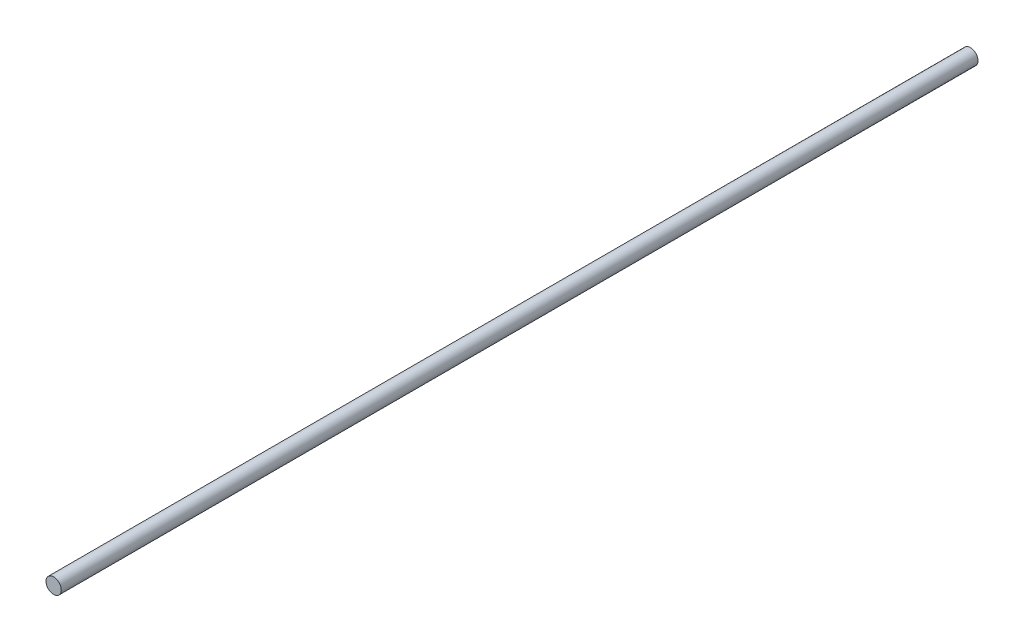
ISO-10303-21;
HEADER;
FILE_DESCRIPTION(('STEP AP214'),'2;1');
FILE_NAME('part.step','',(''),(''),'','','');
FILE_SCHEMA(('AUTOMOTIVE_DESIGN { 1 0 10303 214 1 1 1 1 }'));
ENDSEC;
DATA;
#1=APPLICATION_CONTEXT('core data for automotive mechanical design processes');
#2=APPLICATION_PROTOCOL_DEFINITION('international standard','automotive_design',2000,#1);
#3=PRODUCT_CONTEXT('',#1,'mechanical');
#4=PRODUCT('Part','Part','',(#3));
#5=PRODUCT_RELATED_PRODUCT_CATEGORY('part','',(#4));
#6=PRODUCT_DEFINITION_FORMATION('','',#4);
#7=PRODUCT_DEFINITION_CONTEXT('part definition',#1,'design');
#8=PRODUCT_DEFINITION('design','',#6,#7);
#9=PRODUCT_DEFINITION_SHAPE('','',#8);
#10=(LENGTH_UNIT() NAMED_UNIT(*) SI_UNIT(.MILLI.,.METRE.));
#11=(NAMED_UNIT(*) PLANE_ANGLE_UNIT() SI_UNIT($,.RADIAN.));
#12=(NAMED_UNIT(*) SI_UNIT($,.STERADIAN.) SOLID_ANGLE_UNIT());
#13=UNCERTAINTY_MEASURE_WITH_UNIT(LENGTH_MEASURE(1.E-05),#10,'distance_accuracy_value','');
#14=(GEOMETRIC_REPRESENTATION_CONTEXT(3) GLOBAL_UNCERTAINTY_ASSIGNED_CONTEXT((#13)) GLOBAL_UNIT_ASSIGNED_CONTEXT((#10,
#11,#12)) REPRESENTATION_CONTEXT('',''));
#15=CARTESIAN_POINT('',(0.,0.,0.));
#16=DIRECTION('',(0.,0.,1.));
#17=DIRECTION('',(1.,0.,0.));
#18=AXIS2_PLACEMENT_3D('',#15,#16,#17);
#19=CARTESIAN_POINT('',(0.,0.,476.25));
#20=DIRECTION('',(0.,0.,-1.));
#21=DIRECTION('',(-1.,0.,0.));
#22=AXIS2_PLACEMENT_3D('',#19,#20,#21);
#23=CYLINDRICAL_SURFACE('',#22,3.96875);
#24=CARTESIAN_POINT('',(0.,0.,476.25));
#25=DIRECTION('',(0.,0.,1.));
#26=DIRECTION('',(1.,0.,0.));
#27=AXIS2_PLACEMENT_3D('',#24,#25,#26);
#28=CIRCLE('',#27,3.96875);
#29=CARTESIAN_POINT('',(3.96875,0.,476.25));
#30=VERTEX_POINT('',#29);
#31=EDGE_CURVE('E10',#30,#30,#28,.T.);
#32=ORIENTED_EDGE('',*,*,#31,.F.);
#33=EDGE_LOOP('',(#32));
#34=FACE_BOUND('',#33,.T.);
#35=CARTESIAN_POINT('',(0.,0.,0.));
#36=DIRECTION('',(0.,0.,1.));
#37=DIRECTION('',(1.,0.,0.));
#38=AXIS2_PLACEMENT_3D('',#35,#36,#37);
#39=CIRCLE('',#38,3.96875);
#40=CARTESIAN_POINT('',(3.96875,0.,0.));
#41=VERTEX_POINT('',#40);
#42=EDGE_CURVE('E35',#41,#41,#39,.T.);
#43=ORIENTED_EDGE('',*,*,#42,.T.);
#44=EDGE_LOOP('',(#43));
#45=FACE_BOUND('',#44,.T.);
#46=ADVANCED_FACE('F32',(#34,#45),#23,.T.);
#47=CARTESIAN_POINT('',(0.,0.,476.25));
#48=DIRECTION('',(0.,0.,1.));
#49=DIRECTION('',(1.,0.,0.));
#50=AXIS2_PLACEMENT_3D('',#47,#48,#49);
#51=PLANE('',#50);
#52=ORIENTED_EDGE('',*,*,#31,.T.);
#53=EDGE_LOOP('',(#52));
#54=FACE_BOUND('',#53,.T.);
#55=ADVANCED_FACE('F47',(#54),#51,.T.);
#56=CARTESIAN_POINT('',(0.,0.,0.));
#57=DIRECTION('',(0.,0.,1.));
#58=DIRECTION('',(1.,0.,0.));
#59=AXIS2_PLACEMENT_3D('',#56,#57,#58);
#60=PLANE('',#59);
#61=ORIENTED_EDGE('',*,*,#42,.F.);
#62=EDGE_LOOP('',(#61));
#63=FACE_BOUND('',#62,.T.);
#64=ADVANCED_FACE('F45',(#63),#60,.F.);
#65=CLOSED_SHELL('',(#46,#55,#64));
#66=MANIFOLD_SOLID_BREP('B2',#65);
#67=ADVANCED_BREP_SHAPE_REPRESENTATION('',(#18,#66),#14);
#68=SHAPE_DEFINITION_REPRESENTATION(#9,#67);
ENDSEC;
END-ISO-10303-21;
